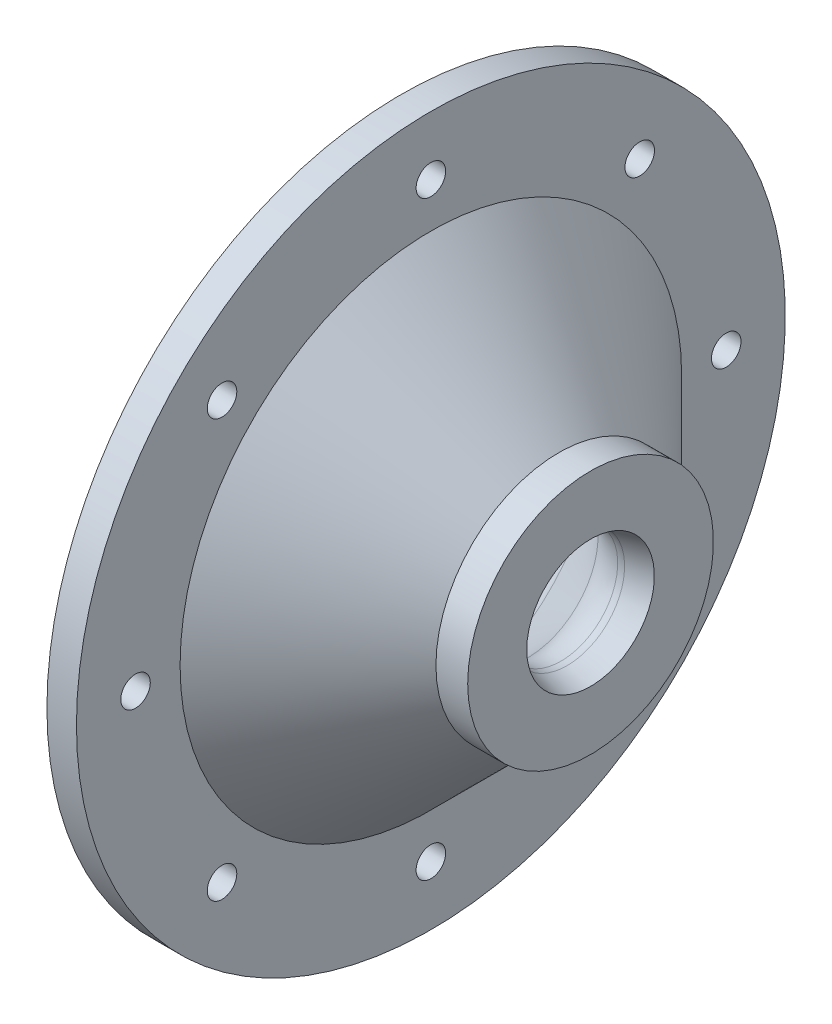
ISO-10303-21;
HEADER;
FILE_DESCRIPTION(('STEP AP214'),'2;1');
FILE_NAME('part.step','',(''),(''),'','','');
FILE_SCHEMA(('AUTOMOTIVE_DESIGN { 1 0 10303 214 1 1 1 1 }'));
ENDSEC;
DATA;
#1=APPLICATION_CONTEXT('core data for automotive mechanical design processes');
#2=APPLICATION_PROTOCOL_DEFINITION('international standard','automotive_design',2000,#1);
#3=PRODUCT_CONTEXT('',#1,'mechanical');
#4=PRODUCT('Part','Part','',(#3));
#5=PRODUCT_RELATED_PRODUCT_CATEGORY('part','',(#4));
#6=PRODUCT_DEFINITION_FORMATION('','',#4);
#7=PRODUCT_DEFINITION_CONTEXT('part definition',#1,'design');
#8=PRODUCT_DEFINITION('design','',#6,#7);
#9=PRODUCT_DEFINITION_SHAPE('','',#8);
#10=(LENGTH_UNIT() NAMED_UNIT(*) SI_UNIT(.MILLI.,.METRE.));
#11=(NAMED_UNIT(*) PLANE_ANGLE_UNIT() SI_UNIT($,.RADIAN.));
#12=(NAMED_UNIT(*) SI_UNIT($,.STERADIAN.) SOLID_ANGLE_UNIT());
#13=UNCERTAINTY_MEASURE_WITH_UNIT(LENGTH_MEASURE(1.E-05),#10,'distance_accuracy_value','');
#14=(GEOMETRIC_REPRESENTATION_CONTEXT(3) GLOBAL_UNCERTAINTY_ASSIGNED_CONTEXT((#13)) GLOBAL_UNIT_ASSIGNED_CONTEXT((#10,
#11,#12)) REPRESENTATION_CONTEXT('',''));
#15=CARTESIAN_POINT('',(0.,0.,0.));
#16=DIRECTION('',(0.,0.,1.));
#17=DIRECTION('',(1.,0.,0.));
#18=AXIS2_PLACEMENT_3D('',#15,#16,#17);
#19=CARTESIAN_POINT('',(3.175,38.1,0.));
#20=DIRECTION('',(-1.,0.,0.));
#21=DIRECTION('',(0.,0.,1.));
#22=AXIS2_PLACEMENT_3D('',#19,#20,#21);
#23=PLANE('',#22);
#24=CARTESIAN_POINT('',(3.175,-1.10854532508269E-13,31.75));
#25=DIRECTION('',(1.,0.,0.));
#26=DIRECTION('',(0.,1.,0.));
#27=AXIS2_PLACEMENT_3D('',#24,#25,#26);
#28=CIRCLE('',#27,1.58749999999999);
#29=CARTESIAN_POINT('',(3.175,1.58749999999988,31.75));
#30=VERTEX_POINT('',#29);
#31=EDGE_CURVE('E84',#30,#30,#28,.T.);
#32=ORIENTED_EDGE('',*,*,#31,.F.);
#33=EDGE_LOOP('',(#32));
#34=FACE_BOUND('',#33,.T.);
#35=CARTESIAN_POINT('',(3.175,-22.450640302673,22.4506403026728));
#36=DIRECTION('',(1.,0.,0.));
#37=DIRECTION('',(0.,0.707106781186544,0.707106781186551));
#38=AXIS2_PLACEMENT_3D('',#35,#36,#37);
#39=CIRCLE('',#38,1.58749999999999);
#40=CARTESIAN_POINT('',(3.175,-21.3281082875394,23.5731723178064));
#41=VERTEX_POINT('',#40);
#42=EDGE_CURVE('E99',#41,#41,#39,.T.);
#43=ORIENTED_EDGE('',*,*,#42,.F.);
#44=EDGE_LOOP('',(#43));
#45=FACE_BOUND('',#44,.T.);
#46=CARTESIAN_POINT('',(3.175,-31.75,0.));
#47=DIRECTION('',(1.,0.,0.));
#48=DIRECTION('',(0.,0.,1.));
#49=AXIS2_PLACEMENT_3D('',#46,#47,#48);
#50=CIRCLE('',#49,1.58749999999999);
#51=CARTESIAN_POINT('',(3.175,-31.75,1.58749999999999));
#52=VERTEX_POINT('',#51);
#53=EDGE_CURVE('E93',#52,#52,#50,.T.);
#54=ORIENTED_EDGE('',*,*,#53,.F.);
#55=EDGE_LOOP('',(#54));
#56=FACE_BOUND('',#55,.T.);
#57=CARTESIAN_POINT('',(3.175,-22.4506403026727,-22.4506403026731));
#58=DIRECTION('',(1.,0.,0.));
#59=DIRECTION('',(0.,-0.707106781186554,0.707106781186541));
#60=AXIS2_PLACEMENT_3D('',#57,#58,#59);
#61=CIRCLE('',#60,1.58749999999999);
#62=CARTESIAN_POINT('',(3.175,-23.5731723178063,-21.3281082875395));
#63=VERTEX_POINT('',#62);
#64=EDGE_CURVE('E85',#63,#63,#61,.T.);
#65=ORIENTED_EDGE('',*,*,#64,.F.);
#66=EDGE_LOOP('',(#65));
#67=FACE_BOUND('',#66,.T.);
#68=CARTESIAN_POINT('',(3.175,3.32563597524808E-13,-31.75));
#69=DIRECTION('',(1.,0.,0.));
#70=DIRECTION('',(0.,-1.,0.));
#71=AXIS2_PLACEMENT_3D('',#68,#69,#70);
#72=CIRCLE('',#71,1.58749999999999);
#73=CARTESIAN_POINT('',(3.175,-1.58749999999966,-31.75));
#74=VERTEX_POINT('',#73);
#75=EDGE_CURVE('E92',#74,#74,#72,.T.);
#76=ORIENTED_EDGE('',*,*,#75,.F.);
#77=EDGE_LOOP('',(#76));
#78=FACE_BOUND('',#77,.T.);
#79=CARTESIAN_POINT('',(3.175,22.4506403026732,-22.4506403026726));
#80=DIRECTION('',(1.,0.,0.));
#81=DIRECTION('',(0.,-0.707106781186539,-0.707106781186556));
#82=AXIS2_PLACEMENT_3D('',#79,#80,#81);
#83=CIRCLE('',#82,1.58749999999999);
#84=CARTESIAN_POINT('',(3.175,21.3281082875395,-23.5731723178063));
#85=VERTEX_POINT('',#84);
#86=EDGE_CURVE('E109',#85,#85,#83,.T.);
#87=ORIENTED_EDGE('',*,*,#86,.F.);
#88=EDGE_LOOP('',(#87));
#89=FACE_BOUND('',#88,.T.);
#90=CARTESIAN_POINT('',(3.175,22.4506403026728,22.4506403026729));
#91=DIRECTION('',(1.,0.,0.));
#92=DIRECTION('',(0.,0.707106781186549,-0.707106781186546));
#93=AXIS2_PLACEMENT_3D('',#90,#91,#92);
#94=CIRCLE('',#93,1.58749999999999);
#95=CARTESIAN_POINT('',(3.175,23.5731723178065,21.3281082875393));
#96=VERTEX_POINT('',#95);
#97=EDGE_CURVE('E78',#96,#96,#94,.T.);
#98=ORIENTED_EDGE('',*,*,#97,.F.);
#99=EDGE_LOOP('',(#98));
#100=FACE_BOUND('',#99,.T.);
#101=CARTESIAN_POINT('',(3.175,31.75,0.));
#102=DIRECTION('',(1.,0.,0.));
#103=DIRECTION('',(0.,0.,-1.));
#104=AXIS2_PLACEMENT_3D('',#101,#102,#103);
#105=CIRCLE('',#104,1.58749999999999);
#106=CARTESIAN_POINT('',(3.175,31.75,-1.58749999999999));
#107=VERTEX_POINT('',#106);
#108=EDGE_CURVE('E75',#107,#107,#105,.T.);
#109=ORIENTED_EDGE('',*,*,#108,.F.);
#110=EDGE_LOOP('',(#109));
#111=FACE_BOUND('',#110,.T.);
#112=CARTESIAN_POINT('',(3.175,0.,0.));
#113=DIRECTION('',(-1.,0.,0.));
#114=DIRECTION('',(0.,0.,1.));
#115=AXIS2_PLACEMENT_3D('',#112,#113,#114);
#116=CIRCLE('',#115,38.1);
#117=CARTESIAN_POINT('',(3.175,0.,38.1));
#118=VERTEX_POINT('',#117);
#119=EDGE_CURVE('E10',#118,#118,#116,.T.);
#120=ORIENTED_EDGE('',*,*,#119,.F.);
#121=EDGE_LOOP('',(#120));
#122=FACE_BOUND('',#121,.T.);
#123=CARTESIAN_POINT('',(3.175,0.,0.));
#124=DIRECTION('',(-1.,0.,0.));
#125=DIRECTION('',(0.,0.,1.));
#126=AXIS2_PLACEMENT_3D('',#123,#124,#125);
#127=CIRCLE('',#126,26.9594610179245);
#128=CARTESIAN_POINT('',(3.175,0.,26.9594610179245));
#129=VERTEX_POINT('',#128);
#130=EDGE_CURVE('E69',#129,#129,#127,.T.);
#131=ORIENTED_EDGE('',*,*,#130,.T.);
#132=EDGE_LOOP('',(#131));
#133=FACE_BOUND('',#132,.T.);
#134=ADVANCED_FACE('F32',(#34,#45,#56,#67,#78,#89,#100,#111,#122,#133),#23,.F.);
#135=CARTESIAN_POINT('',(0.,0.,0.));
#136=DIRECTION('',(-1.,0.,0.));
#137=DIRECTION('',(0.,0.,1.));
#138=AXIS2_PLACEMENT_3D('',#135,#136,#137);
#139=CYLINDRICAL_SURFACE('',#138,38.1);
#140=CARTESIAN_POINT('',(0.,0.,0.));
#141=DIRECTION('',(-1.,0.,0.));
#142=DIRECTION('',(0.,0.,1.));
#143=AXIS2_PLACEMENT_3D('',#140,#141,#142);
#144=CIRCLE('',#143,38.1);
#145=CARTESIAN_POINT('',(0.,0.,38.1));
#146=VERTEX_POINT('',#145);
#147=EDGE_CURVE('E38',#146,#146,#144,.T.);
#148=ORIENTED_EDGE('',*,*,#147,.F.);
#149=EDGE_LOOP('',(#148));
#150=FACE_BOUND('',#149,.T.);
#151=ORIENTED_EDGE('',*,*,#119,.T.);
#152=EDGE_LOOP('',(#151));
#153=FACE_BOUND('',#152,.T.);
#154=ADVANCED_FACE('F134',(#150,#153),#139,.T.);
#155=CARTESIAN_POINT('',(0.,19.05,0.));
#156=DIRECTION('',(1.,0.,0.));
#157=DIRECTION('',(0.,0.,-1.));
#158=AXIS2_PLACEMENT_3D('',#155,#156,#157);
#159=PLANE('',#158);
#160=CARTESIAN_POINT('',(0.,-1.10854532508269E-13,31.75));
#161=DIRECTION('',(1.,0.,0.));
#162=DIRECTION('',(0.,1.,0.));
#163=AXIS2_PLACEMENT_3D('',#160,#161,#162);
#164=CIRCLE('',#163,1.5875);
#165=CARTESIAN_POINT('',(0.,1.58749999999989,31.75));
#166=VERTEX_POINT('',#165);
#167=EDGE_CURVE('E102',#166,#166,#164,.T.);
#168=ORIENTED_EDGE('',*,*,#167,.T.);
#169=EDGE_LOOP('',(#168));
#170=FACE_BOUND('',#169,.T.);
#171=CARTESIAN_POINT('',(0.,-22.450640302673,22.4506403026728));
#172=DIRECTION('',(1.,0.,0.));
#173=DIRECTION('',(0.,0.707106781186544,0.707106781186551));
#174=AXIS2_PLACEMENT_3D('',#171,#172,#173);
#175=CIRCLE('',#174,1.5875);
#176=CARTESIAN_POINT('',(0.,-21.3281082875394,23.5731723178064));
#177=VERTEX_POINT('',#176);
#178=EDGE_CURVE('E96',#177,#177,#175,.T.);
#179=ORIENTED_EDGE('',*,*,#178,.T.);
#180=EDGE_LOOP('',(#179));
#181=FACE_BOUND('',#180,.T.);
#182=CARTESIAN_POINT('',(0.,-31.75,0.));
#183=DIRECTION('',(1.,0.,0.));
#184=DIRECTION('',(0.,0.,1.));
#185=AXIS2_PLACEMENT_3D('',#182,#183,#184);
#186=CIRCLE('',#185,1.5875);
#187=CARTESIAN_POINT('',(0.,-31.75,1.5875));
#188=VERTEX_POINT('',#187);
#189=EDGE_CURVE('E88',#188,#188,#186,.T.);
#190=ORIENTED_EDGE('',*,*,#189,.T.);
#191=EDGE_LOOP('',(#190));
#192=FACE_BOUND('',#191,.T.);
#193=CARTESIAN_POINT('',(0.,-22.4506403026727,-22.4506403026731));
#194=DIRECTION('',(1.,0.,0.));
#195=DIRECTION('',(0.,-0.707106781186554,0.707106781186541));
#196=AXIS2_PLACEMENT_3D('',#193,#194,#195);
#197=CIRCLE('',#196,1.5875);
#198=CARTESIAN_POINT('',(0.,-23.5731723178063,-21.3281082875394));
#199=VERTEX_POINT('',#198);
#200=EDGE_CURVE('E89',#199,#199,#197,.T.);
#201=ORIENTED_EDGE('',*,*,#200,.T.);
#202=EDGE_LOOP('',(#201));
#203=FACE_BOUND('',#202,.T.);
#204=CARTESIAN_POINT('',(0.,3.32563597524808E-13,-31.75));
#205=DIRECTION('',(1.,0.,0.));
#206=DIRECTION('',(0.,-1.,0.));
#207=AXIS2_PLACEMENT_3D('',#204,#205,#206);
#208=CIRCLE('',#207,1.5875);
#209=CARTESIAN_POINT('',(0.,-1.58749999999967,-31.75));
#210=VERTEX_POINT('',#209);
#211=EDGE_CURVE('E112',#210,#210,#208,.T.);
#212=ORIENTED_EDGE('',*,*,#211,.T.);
#213=EDGE_LOOP('',(#212));
#214=FACE_BOUND('',#213,.T.);
#215=CARTESIAN_POINT('',(0.,22.4506403026732,-22.4506403026726));
#216=DIRECTION('',(1.,0.,0.));
#217=DIRECTION('',(0.,-0.707106781186539,-0.707106781186556));
#218=AXIS2_PLACEMENT_3D('',#215,#216,#217);
#219=CIRCLE('',#218,1.5875);
#220=CARTESIAN_POINT('',(0.,21.3281082875395,-23.5731723178063));
#221=VERTEX_POINT('',#220);
#222=EDGE_CURVE('E113',#221,#221,#219,.T.);
#223=ORIENTED_EDGE('',*,*,#222,.T.);
#224=EDGE_LOOP('',(#223));
#225=FACE_BOUND('',#224,.T.);
#226=CARTESIAN_POINT('',(0.,22.4506403026728,22.4506403026729));
#227=DIRECTION('',(1.,0.,0.));
#228=DIRECTION('',(0.,0.707106781186549,-0.707106781186546));
#229=AXIS2_PLACEMENT_3D('',#226,#227,#228);
#230=CIRCLE('',#229,1.5875);
#231=CARTESIAN_POINT('',(0.,23.5731723178065,21.3281082875393));
#232=VERTEX_POINT('',#231);
#233=EDGE_CURVE('E81',#232,#232,#230,.T.);
#234=ORIENTED_EDGE('',*,*,#233,.T.);
#235=EDGE_LOOP('',(#234));
#236=FACE_BOUND('',#235,.T.);
#237=CARTESIAN_POINT('',(0.,31.75,0.));
#238=DIRECTION('',(1.,0.,0.));
#239=DIRECTION('',(0.,0.,-1.));
#240=AXIS2_PLACEMENT_3D('',#237,#238,#239);
#241=CIRCLE('',#240,1.5875);
#242=CARTESIAN_POINT('',(0.,31.75,-1.5875));
#243=VERTEX_POINT('',#242);
#244=EDGE_CURVE('E72',#243,#243,#241,.T.);
#245=ORIENTED_EDGE('',*,*,#244,.T.);
#246=EDGE_LOOP('',(#245));
#247=FACE_BOUND('',#246,.T.);
#248=CARTESIAN_POINT('',(0.,0.,0.));
#249=DIRECTION('',(-1.,0.,0.));
#250=DIRECTION('',(0.,0.,1.));
#251=AXIS2_PLACEMENT_3D('',#248,#249,#250);
#252=CIRCLE('',#251,19.05);
#253=CARTESIAN_POINT('',(0.,0.,19.05));
#254=VERTEX_POINT('',#253);
#255=EDGE_CURVE('E42',#254,#254,#252,.T.);
#256=ORIENTED_EDGE('',*,*,#255,.F.);
#257=EDGE_LOOP('',(#256));
#258=FACE_BOUND('',#257,.T.);
#259=ORIENTED_EDGE('',*,*,#147,.T.);
#260=EDGE_LOOP('',(#259));
#261=FACE_BOUND('',#260,.T.);
#262=ADVANCED_FACE('F121',(#170,#181,#192,#203,#214,#225,#236,#247,#258,#261),#159,.F.);
#263=CARTESIAN_POINT('',(0.,0.,0.));
#264=DIRECTION('',(-1.,0.,0.));
#265=DIRECTION('',(0.,0.,1.));
#266=AXIS2_PLACEMENT_3D('',#263,#264,#265);
#267=TOROIDAL_SURFACE('',#266,13.97,5.08);
#268=CARTESIAN_POINT('',(3.59210244842767,0.,0.));
#269=DIRECTION('',(-1.,0.,0.));
#270=DIRECTION('',(0.,0.,1.));
#271=AXIS2_PLACEMENT_3D('',#268,#269,#270);
#272=CIRCLE('',#271,17.5621024484277);
#273=CARTESIAN_POINT('',(3.59210244842767,0.,17.5621024484277));
#274=VERTEX_POINT('',#273);
#275=EDGE_CURVE('E46',#274,#274,#272,.T.);
#276=ORIENTED_EDGE('',*,*,#275,.F.);
#277=EDGE_LOOP('',(#276));
#278=FACE_BOUND('',#277,.T.);
#279=ORIENTED_EDGE('',*,*,#255,.T.);
#280=EDGE_LOOP('',(#279));
#281=FACE_BOUND('',#280,.T.);
#282=ADVANCED_FACE('F185',(#278,#281),#267,.F.);
#283=CARTESIAN_POINT('',(3.59210244842767,0.,0.));
#284=DIRECTION('',(-1.,0.,0.));
#285=DIRECTION('',(0.,0.,1.));
#286=AXIS2_PLACEMENT_3D('',#283,#284,#285);
#287=CONICAL_SURFACE('',#286,17.5621024484277,0.78539816339745);
#288=CARTESIAN_POINT('',(13.5703073452829,0.,0.));
#289=DIRECTION('',(-1.,0.,0.));
#290=DIRECTION('',(0.,0.,1.));
#291=AXIS2_PLACEMENT_3D('',#288,#289,#290);
#292=CIRCLE('',#291,7.58389755157235);
#293=CARTESIAN_POINT('',(13.5703073452829,0.,7.58389755157235));
#294=VERTEX_POINT('',#293);
#295=EDGE_CURVE('E51',#294,#294,#292,.T.);
#296=ORIENTED_EDGE('',*,*,#295,.F.);
#297=EDGE_LOOP('',(#296));
#298=FACE_BOUND('',#297,.T.);
#299=ORIENTED_EDGE('',*,*,#275,.T.);
#300=EDGE_LOOP('',(#299));
#301=FACE_BOUND('',#300,.T.);
#302=ADVANCED_FACE('F179',(#298,#301),#287,.F.);
#303=CARTESIAN_POINT('',(17.1624097937106,0.,0.));
#304=DIRECTION('',(-1.,0.,0.));
#305=DIRECTION('',(0.,0.,1.));
#306=AXIS2_PLACEMENT_3D('',#303,#304,#305);
#307=TOROIDAL_SURFACE('',#306,11.176,5.08);
#308=CARTESIAN_POINT('',(17.1624097937106,0.,0.));
#309=DIRECTION('',(-1.,0.,0.));
#310=DIRECTION('',(0.,0.,1.));
#311=AXIS2_PLACEMENT_3D('',#308,#309,#310);
#312=CIRCLE('',#311,6.096);
#313=CARTESIAN_POINT('',(17.1624097937106,0.,6.096));
#314=VERTEX_POINT('',#313);
#315=EDGE_CURVE('E54',#314,#314,#312,.T.);
#316=ORIENTED_EDGE('',*,*,#315,.F.);
#317=EDGE_LOOP('',(#316));
#318=FACE_BOUND('',#317,.T.);
#319=ORIENTED_EDGE('',*,*,#295,.T.);
#320=EDGE_LOOP('',(#319));
#321=FACE_BOUND('',#320,.T.);
#322=ADVANCED_FACE('F173',(#318,#321),#307,.T.);
#323=CARTESIAN_POINT('',(17.1624097937106,0.,0.));
#324=DIRECTION('',(-1.,0.,0.));
#325=DIRECTION('',(0.,0.,1.));
#326=AXIS2_PLACEMENT_3D('',#323,#324,#325);
#327=TOROIDAL_SURFACE('',#326,8.636,2.54);
#328=CARTESIAN_POINT('',(17.819810168271,0.,0.));
#329=DIRECTION('',(-1.,0.,0.));
#330=DIRECTION('',(0.,0.,1.));
#331=AXIS2_PLACEMENT_3D('',#328,#329,#330);
#332=CIRCLE('',#331,6.18254840122577);
#333=CARTESIAN_POINT('',(17.819810168271,0.,6.18254840122577));
#334=VERTEX_POINT('',#333);
#335=EDGE_CURVE('E57',#334,#334,#332,.T.);
#336=ORIENTED_EDGE('',*,*,#335,.F.);
#337=EDGE_LOOP('',(#336));
#338=FACE_BOUND('',#337,.T.);
#339=ORIENTED_EDGE('',*,*,#315,.T.);
#340=EDGE_LOOP('',(#339));
#341=FACE_BOUND('',#340,.T.);
#342=ADVANCED_FACE('F167',(#338,#341),#327,.T.);
#343=CARTESIAN_POINT('',(17.819810168271,0.,0.));
#344=DIRECTION('',(1.,0.,0.));
#345=DIRECTION('',(0.,0.,-1.));
#346=AXIS2_PLACEMENT_3D('',#343,#344,#345);
#347=CONICAL_SURFACE('',#346,6.18254840122577,0.261799387799151);
#348=CARTESIAN_POINT('',(20.3406298529501,0.,0.));
#349=DIRECTION('',(-1.,0.,0.));
#350=DIRECTION('',(0.,0.,1.));
#351=AXIS2_PLACEMENT_3D('',#348,#349,#350);
#352=CIRCLE('',#351,6.858);
#353=CARTESIAN_POINT('',(20.3406298529501,0.,6.858));
#354=VERTEX_POINT('',#353);
#355=EDGE_CURVE('E60',#354,#354,#352,.T.);
#356=ORIENTED_EDGE('',*,*,#355,.F.);
#357=EDGE_LOOP('',(#356));
#358=FACE_BOUND('',#357,.T.);
#359=ORIENTED_EDGE('',*,*,#335,.T.);
#360=EDGE_LOOP('',(#359));
#361=FACE_BOUND('',#360,.T.);
#362=ADVANCED_FACE('F161',(#358,#361),#347,.F.);
#363=CARTESIAN_POINT('',(20.3406298529501,6.858,0.));
#364=DIRECTION('',(-1.,0.,0.));
#365=DIRECTION('',(0.,0.,1.));
#366=AXIS2_PLACEMENT_3D('',#363,#364,#365);
#367=PLANE('',#366);
#368=CARTESIAN_POINT('',(20.3406298529501,0.,0.));
#369=DIRECTION('',(-1.,0.,0.));
#370=DIRECTION('',(0.,0.,1.));
#371=AXIS2_PLACEMENT_3D('',#368,#369,#370);
#372=CIRCLE('',#371,13.208);
#373=CARTESIAN_POINT('',(20.3406298529501,0.,13.208));
#374=VERTEX_POINT('',#373);
#375=EDGE_CURVE('E63',#374,#374,#372,.T.);
#376=ORIENTED_EDGE('',*,*,#375,.F.);
#377=EDGE_LOOP('',(#376));
#378=FACE_BOUND('',#377,.T.);
#379=ORIENTED_EDGE('',*,*,#355,.T.);
#380=EDGE_LOOP('',(#379));
#381=FACE_BOUND('',#380,.T.);
#382=ADVANCED_FACE('F155',(#378,#381),#367,.F.);
#383=CARTESIAN_POINT('',(0.,0.,0.));
#384=DIRECTION('',(-1.,0.,0.));
#385=DIRECTION('',(0.,0.,1.));
#386=AXIS2_PLACEMENT_3D('',#383,#384,#385);
#387=CYLINDRICAL_SURFACE('',#386,13.208);
#388=CARTESIAN_POINT('',(16.9264610179244,0.,0.));
#389=DIRECTION('',(-1.,0.,0.));
#390=DIRECTION('',(0.,0.,1.));
#391=AXIS2_PLACEMENT_3D('',#388,#389,#390);
#392=CIRCLE('',#391,13.208);
#393=CARTESIAN_POINT('',(16.9264610179244,0.,13.208));
#394=VERTEX_POINT('',#393);
#395=EDGE_CURVE('E66',#394,#394,#392,.T.);
#396=ORIENTED_EDGE('',*,*,#395,.F.);
#397=EDGE_LOOP('',(#396));
#398=FACE_BOUND('',#397,.T.);
#399=ORIENTED_EDGE('',*,*,#375,.T.);
#400=EDGE_LOOP('',(#399));
#401=FACE_BOUND('',#400,.T.);
#402=ADVANCED_FACE('F149',(#398,#401),#387,.T.);
#403=CARTESIAN_POINT('',(16.9264610179244,0.,0.));
#404=DIRECTION('',(-1.,0.,0.));
#405=DIRECTION('',(0.,0.,1.));
#406=AXIS2_PLACEMENT_3D('',#403,#404,#405);
#407=CONICAL_SURFACE('',#406,13.208,0.78539816339745);
#408=ORIENTED_EDGE('',*,*,#130,.F.);
#409=EDGE_LOOP('',(#408));
#410=FACE_BOUND('',#409,.T.);
#411=ORIENTED_EDGE('',*,*,#395,.T.);
#412=EDGE_LOOP('',(#411));
#413=FACE_BOUND('',#412,.T.);
#414=ADVANCED_FACE('F145',(#410,#413),#407,.T.);
#415=CARTESIAN_POINT('',(3.175,31.75,0.));
#416=DIRECTION('',(1.,0.,0.));
#417=DIRECTION('',(0.,0.,-1.));
#418=AXIS2_PLACEMENT_3D('',#415,#416,#417);
#419=CYLINDRICAL_SURFACE('',#418,1.5875);
#420=ORIENTED_EDGE('',*,*,#244,.F.);
#421=EDGE_LOOP('',(#420));
#422=FACE_BOUND('',#421,.T.);
#423=ORIENTED_EDGE('',*,*,#108,.T.);
#424=EDGE_LOOP('',(#423));
#425=FACE_BOUND('',#424,.T.);
#426=ADVANCED_FACE('F148',(#422,#425),#419,.F.);
#427=CARTESIAN_POINT('',(3.175,22.4506403026728,22.4506403026729));
#428=DIRECTION('',(1.,0.,0.));
#429=DIRECTION('',(0.,0.707106781186549,-0.707106781186546));
#430=AXIS2_PLACEMENT_3D('',#427,#428,#429);
#431=CYLINDRICAL_SURFACE('',#430,1.5875);
#432=ORIENTED_EDGE('',*,*,#233,.F.);
#433=EDGE_LOOP('',(#432));
#434=FACE_BOUND('',#433,.T.);
#435=ORIENTED_EDGE('',*,*,#97,.T.);
#436=EDGE_LOOP('',(#435));
#437=FACE_BOUND('',#436,.T.);
#438=ADVANCED_FACE('F205',(#434,#437),#431,.F.);
#439=CARTESIAN_POINT('',(3.175,22.4506403026732,-22.4506403026726));
#440=DIRECTION('',(1.,0.,0.));
#441=DIRECTION('',(0.,-0.707106781186539,-0.707106781186556));
#442=AXIS2_PLACEMENT_3D('',#439,#440,#441);
#443=CYLINDRICAL_SURFACE('',#442,1.5875);
#444=ORIENTED_EDGE('',*,*,#222,.F.);
#445=EDGE_LOOP('',(#444));
#446=FACE_BOUND('',#445,.T.);
#447=ORIENTED_EDGE('',*,*,#86,.T.);
#448=EDGE_LOOP('',(#447));
#449=FACE_BOUND('',#448,.T.);
#450=ADVANCED_FACE('F128',(#446,#449),#443,.F.);
#451=CARTESIAN_POINT('',(3.175,3.32563597524808E-13,-31.75));
#452=DIRECTION('',(1.,0.,0.));
#453=DIRECTION('',(0.,-1.,0.));
#454=AXIS2_PLACEMENT_3D('',#451,#452,#453);
#455=CYLINDRICAL_SURFACE('',#454,1.5875);
#456=ORIENTED_EDGE('',*,*,#211,.F.);
#457=EDGE_LOOP('',(#456));
#458=FACE_BOUND('',#457,.T.);
#459=ORIENTED_EDGE('',*,*,#75,.T.);
#460=EDGE_LOOP('',(#459));
#461=FACE_BOUND('',#460,.T.);
#462=ADVANCED_FACE('F124',(#458,#461),#455,.F.);
#463=CARTESIAN_POINT('',(3.175,-22.4506403026727,-22.4506403026731));
#464=DIRECTION('',(1.,0.,0.));
#465=DIRECTION('',(0.,-0.707106781186554,0.707106781186541));
#466=AXIS2_PLACEMENT_3D('',#463,#464,#465);
#467=CYLINDRICAL_SURFACE('',#466,1.5875);
#468=ORIENTED_EDGE('',*,*,#200,.F.);
#469=EDGE_LOOP('',(#468));
#470=FACE_BOUND('',#469,.T.);
#471=ORIENTED_EDGE('',*,*,#64,.T.);
#472=EDGE_LOOP('',(#471));
#473=FACE_BOUND('',#472,.T.);
#474=ADVANCED_FACE('F127',(#470,#473),#467,.F.);
#475=CARTESIAN_POINT('',(3.175,-31.75,0.));
#476=DIRECTION('',(1.,0.,0.));
#477=DIRECTION('',(0.,0.,1.));
#478=AXIS2_PLACEMENT_3D('',#475,#476,#477);
#479=CYLINDRICAL_SURFACE('',#478,1.5875);
#480=ORIENTED_EDGE('',*,*,#189,.F.);
#481=EDGE_LOOP('',(#480));
#482=FACE_BOUND('',#481,.T.);
#483=ORIENTED_EDGE('',*,*,#53,.T.);
#484=EDGE_LOOP('',(#483));
#485=FACE_BOUND('',#484,.T.);
#486=ADVANCED_FACE('F212',(#482,#485),#479,.F.);
#487=CARTESIAN_POINT('',(3.175,-22.450640302673,22.4506403026728));
#488=DIRECTION('',(1.,0.,0.));
#489=DIRECTION('',(0.,0.707106781186544,0.707106781186551));
#490=AXIS2_PLACEMENT_3D('',#487,#488,#489);
#491=CYLINDRICAL_SURFACE('',#490,1.5875);
#492=ORIENTED_EDGE('',*,*,#178,.F.);
#493=EDGE_LOOP('',(#492));
#494=FACE_BOUND('',#493,.T.);
#495=ORIENTED_EDGE('',*,*,#42,.T.);
#496=EDGE_LOOP('',(#495));
#497=FACE_BOUND('',#496,.T.);
#498=ADVANCED_FACE('F216',(#494,#497),#491,.F.);
#499=CARTESIAN_POINT('',(3.175,-1.10854532508269E-13,31.75));
#500=DIRECTION('',(1.,0.,0.));
#501=DIRECTION('',(0.,1.,0.));
#502=AXIS2_PLACEMENT_3D('',#499,#500,#501);
#503=CYLINDRICAL_SURFACE('',#502,1.5875);
#504=ORIENTED_EDGE('',*,*,#167,.F.);
#505=EDGE_LOOP('',(#504));
#506=FACE_BOUND('',#505,.T.);
#507=ORIENTED_EDGE('',*,*,#31,.T.);
#508=EDGE_LOOP('',(#507));
#509=FACE_BOUND('',#508,.T.);
#510=ADVANCED_FACE('F220',(#506,#509),#503,.F.);
#511=CLOSED_SHELL('',(#134,#154,#262,#282,#302,#322,#342,#362,#382,#402,#414,#426,#438,#450,
#462,#474,#486,#498,#510));
#512=MANIFOLD_SOLID_BREP('B2',#511);
#513=ADVANCED_BREP_SHAPE_REPRESENTATION('',(#18,#512),#14);
#514=SHAPE_DEFINITION_REPRESENTATION(#9,#513);
ENDSEC;
END-ISO-10303-21;
